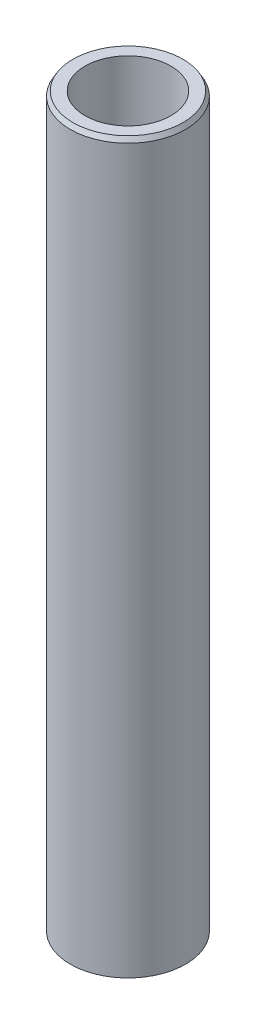
ISO-10303-21;
HEADER;
FILE_DESCRIPTION(('STEP AP214'),'2;1');
FILE_NAME('part.step','',(''),(''),'','','');
FILE_SCHEMA(('AUTOMOTIVE_DESIGN { 1 0 10303 214 1 1 1 1 }'));
ENDSEC;
DATA;
#1=APPLICATION_CONTEXT('core data for automotive mechanical design processes');
#2=APPLICATION_PROTOCOL_DEFINITION('international standard','automotive_design',2000,#1);
#3=PRODUCT_CONTEXT('',#1,'mechanical');
#4=PRODUCT('Part','Part','',(#3));
#5=PRODUCT_RELATED_PRODUCT_CATEGORY('part','',(#4));
#6=PRODUCT_DEFINITION_FORMATION('','',#4);
#7=PRODUCT_DEFINITION_CONTEXT('part definition',#1,'design');
#8=PRODUCT_DEFINITION('design','',#6,#7);
#9=PRODUCT_DEFINITION_SHAPE('','',#8);
#10=(LENGTH_UNIT() NAMED_UNIT(*) SI_UNIT(.MILLI.,.METRE.));
#11=(NAMED_UNIT(*) PLANE_ANGLE_UNIT() SI_UNIT($,.RADIAN.));
#12=(NAMED_UNIT(*) SI_UNIT($,.STERADIAN.) SOLID_ANGLE_UNIT());
#13=UNCERTAINTY_MEASURE_WITH_UNIT(LENGTH_MEASURE(1.E-05),#10,'distance_accuracy_value','');
#14=(GEOMETRIC_REPRESENTATION_CONTEXT(3) GLOBAL_UNCERTAINTY_ASSIGNED_CONTEXT((#13)) GLOBAL_UNIT_ASSIGNED_CONTEXT((#10,
#11,#12)) REPRESENTATION_CONTEXT('',''));
#15=CARTESIAN_POINT('',(0.,0.,0.));
#16=DIRECTION('',(0.,0.,1.));
#17=DIRECTION('',(1.,0.,0.));
#18=AXIS2_PLACEMENT_3D('',#15,#16,#17);
#19=CARTESIAN_POINT('',(0.,158.355854702228,0.));
#20=DIRECTION('',(0.,-1.,0.));
#21=DIRECTION('',(0.,0.,-1.));
#22=AXIS2_PLACEMENT_3D('',#19,#20,#21);
#23=CYLINDRICAL_SURFACE('',#22,12.5);
#24=CARTESIAN_POINT('',(0.,157.356869873612,0.));
#25=DIRECTION('',(0.,1.,0.));
#26=DIRECTION('',(0.,0.,1.));
#27=AXIS2_PLACEMENT_3D('',#24,#25,#26);
#28=CIRCLE('',#27,12.5);
#29=CARTESIAN_POINT('',(0.,157.356869873612,12.5));
#30=VERTEX_POINT('',#29);
#31=EDGE_CURVE('E50',#30,#30,#28,.F.);
#32=ORIENTED_EDGE('',*,*,#31,.T.);
#33=EDGE_LOOP('',(#32));
#34=FACE_BOUND('',#33,.T.);
#35=CARTESIAN_POINT('',(0.,0.576764159717746,0.));
#36=DIRECTION('',(0.,1.,0.));
#37=DIRECTION('',(0.,0.,1.));
#38=AXIS2_PLACEMENT_3D('',#35,#36,#37);
#39=CIRCLE('',#38,12.5);
#40=CARTESIAN_POINT('',(0.,0.576764159717746,12.5));
#41=VERTEX_POINT('',#40);
#42=EDGE_CURVE('E51',#41,#41,#39,.T.);
#43=ORIENTED_EDGE('',*,*,#42,.T.);
#44=EDGE_LOOP('',(#43));
#45=FACE_BOUND('',#44,.T.);
#46=ADVANCED_FACE('F39',(#34,#45),#23,.T.);
#47=CARTESIAN_POINT('',(0.,158.355854702228,0.));
#48=DIRECTION('',(0.,1.,0.));
#49=DIRECTION('',(0.,0.,1.));
#50=AXIS2_PLACEMENT_3D('',#47,#48,#49);
#51=PLANE('',#50);
#52=CARTESIAN_POINT('',(0.,158.355854702228,0.));
#53=DIRECTION('',(0.,1.,0.));
#54=DIRECTION('',(0.,0.,1.));
#55=AXIS2_PLACEMENT_3D('',#52,#53,#54);
#56=CIRCLE('',#55,11.9232358402822);
#57=CARTESIAN_POINT('',(0.,158.355854702228,11.9232358402822));
#58=VERTEX_POINT('',#57);
#59=EDGE_CURVE('E54',#58,#58,#56,.T.);
#60=ORIENTED_EDGE('',*,*,#59,.T.);
#61=EDGE_LOOP('',(#60));
#62=FACE_BOUND('',#61,.T.);
#63=CARTESIAN_POINT('',(0.,158.355854702228,0.));
#64=DIRECTION('',(0.,1.,0.));
#65=DIRECTION('',(0.,0.,1.));
#66=AXIS2_PLACEMENT_3D('',#63,#64,#65);
#67=CIRCLE('',#66,9.32265251596125);
#68=CARTESIAN_POINT('',(0.,158.355854702228,9.32265251596125));
#69=VERTEX_POINT('',#68);
#70=EDGE_CURVE('E58',#69,#69,#67,.T.);
#71=ORIENTED_EDGE('',*,*,#70,.F.);
#72=EDGE_LOOP('',(#71));
#73=FACE_BOUND('',#72,.T.);
#74=ADVANCED_FACE('F69',(#62,#73),#51,.T.);
#75=CARTESIAN_POINT('',(0.,0.,0.));
#76=DIRECTION('',(0.,1.,0.));
#77=DIRECTION('',(0.,0.,1.));
#78=AXIS2_PLACEMENT_3D('',#75,#76,#77);
#79=PLANE('',#78);
#80=CARTESIAN_POINT('',(0.,0.,0.));
#81=DIRECTION('',(0.,1.,0.));
#82=DIRECTION('',(0.,0.,1.));
#83=AXIS2_PLACEMENT_3D('',#80,#81,#82);
#84=CIRCLE('',#83,11.5010151713841);
#85=CARTESIAN_POINT('',(0.,0.,11.5010151713841));
#86=VERTEX_POINT('',#85);
#87=EDGE_CURVE('E10',#86,#86,#84,.F.);
#88=ORIENTED_EDGE('',*,*,#87,.T.);
#89=EDGE_LOOP('',(#88));
#90=FACE_BOUND('',#89,.T.);
#91=CARTESIAN_POINT('',(0.,0.,0.));
#92=DIRECTION('',(0.,1.,0.));
#93=DIRECTION('',(0.,0.,1.));
#94=AXIS2_PLACEMENT_3D('',#91,#92,#93);
#95=CIRCLE('',#94,9.32265251596125);
#96=CARTESIAN_POINT('',(0.,0.,9.32265251596125));
#97=VERTEX_POINT('',#96);
#98=EDGE_CURVE('E63',#97,#97,#95,.T.);
#99=ORIENTED_EDGE('',*,*,#98,.T.);
#100=EDGE_LOOP('',(#99));
#101=FACE_BOUND('',#100,.T.);
#102=ADVANCED_FACE('F75',(#90,#101),#79,.F.);
#103=CARTESIAN_POINT('',(0.,158.355854702228,0.));
#104=DIRECTION('',(0.,-1.,0.));
#105=DIRECTION('',(0.,0.,-1.));
#106=AXIS2_PLACEMENT_3D('',#103,#104,#105);
#107=CYLINDRICAL_SURFACE('',#106,9.32265251596125);
#108=ORIENTED_EDGE('',*,*,#70,.T.);
#109=EDGE_LOOP('',(#108));
#110=FACE_BOUND('',#109,.T.);
#111=ORIENTED_EDGE('',*,*,#98,.F.);
#112=EDGE_LOOP('',(#111));
#113=FACE_BOUND('',#112,.T.);
#114=ADVANCED_FACE('F70',(#110,#113),#107,.F.);
#115=CARTESIAN_POINT('',(0.,158.355854702228,0.));
#116=DIRECTION('',(0.,-1.,0.));
#117=DIRECTION('',(0.,0.,-1.));
#118=AXIS2_PLACEMENT_3D('',#115,#116,#117);
#119=CONICAL_SURFACE('',#118,11.9232358402822,0.523598775598288);
#120=ORIENTED_EDGE('',*,*,#31,.F.);
#121=EDGE_LOOP('',(#120));
#122=FACE_BOUND('',#121,.T.);
#123=ORIENTED_EDGE('',*,*,#59,.F.);
#124=EDGE_LOOP('',(#123));
#125=FACE_BOUND('',#124,.T.);
#126=ADVANCED_FACE('F81',(#122,#125),#119,.T.);
#127=CARTESIAN_POINT('',(0.,0.576764159717746,0.));
#128=DIRECTION('',(0.,1.,0.));
#129=DIRECTION('',(0.,0.,1.));
#130=AXIS2_PLACEMENT_3D('',#127,#128,#129);
#131=CONICAL_SURFACE('',#130,12.5,1.04719755119659);
#132=ORIENTED_EDGE('',*,*,#87,.F.);
#133=EDGE_LOOP('',(#132));
#134=FACE_BOUND('',#133,.T.);
#135=ORIENTED_EDGE('',*,*,#42,.F.);
#136=EDGE_LOOP('',(#135));
#137=FACE_BOUND('',#136,.T.);
#138=ADVANCED_FACE('F45',(#134,#137),#131,.T.);
#139=CLOSED_SHELL('',(#46,#74,#102,#114,#126,#138));
#140=MANIFOLD_SOLID_BREP('B2',#139);
#141=ADVANCED_BREP_SHAPE_REPRESENTATION('',(#18,#140),#14);
#142=SHAPE_DEFINITION_REPRESENTATION(#9,#141);
ENDSEC;
END-ISO-10303-21;
